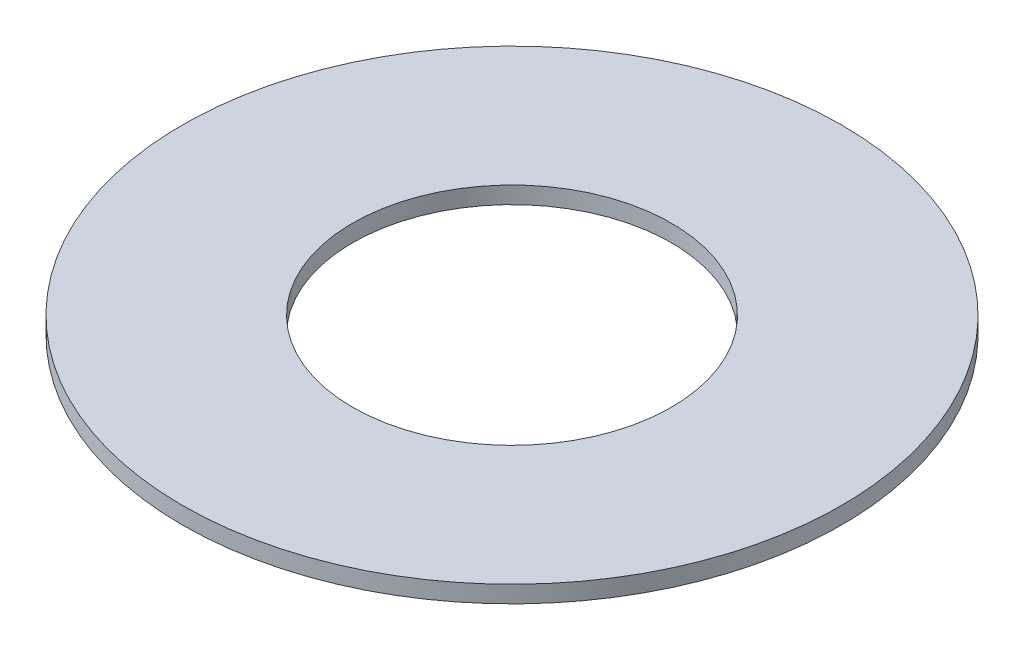
ISO-10303-21;
HEADER;
FILE_DESCRIPTION(('STEP AP214'),'2;1');
FILE_NAME('part.step','',(''),(''),'','','');
FILE_SCHEMA(('AUTOMOTIVE_DESIGN { 1 0 10303 214 1 1 1 1 }'));
ENDSEC;
DATA;
#1=APPLICATION_CONTEXT('core data for automotive mechanical design processes');
#2=APPLICATION_PROTOCOL_DEFINITION('international standard','automotive_design',2000,#1);
#3=PRODUCT_CONTEXT('',#1,'mechanical');
#4=PRODUCT('Part','Part','',(#3));
#5=PRODUCT_RELATED_PRODUCT_CATEGORY('part','',(#4));
#6=PRODUCT_DEFINITION_FORMATION('','',#4);
#7=PRODUCT_DEFINITION_CONTEXT('part definition',#1,'design');
#8=PRODUCT_DEFINITION('design','',#6,#7);
#9=PRODUCT_DEFINITION_SHAPE('','',#8);
#10=(LENGTH_UNIT() NAMED_UNIT(*) SI_UNIT(.MILLI.,.METRE.));
#11=(NAMED_UNIT(*) PLANE_ANGLE_UNIT() SI_UNIT($,.RADIAN.));
#12=(NAMED_UNIT(*) SI_UNIT($,.STERADIAN.) SOLID_ANGLE_UNIT());
#13=UNCERTAINTY_MEASURE_WITH_UNIT(LENGTH_MEASURE(1.E-05),#10,'distance_accuracy_value','');
#14=(GEOMETRIC_REPRESENTATION_CONTEXT(3) GLOBAL_UNCERTAINTY_ASSIGNED_CONTEXT((#13)) GLOBAL_UNIT_ASSIGNED_CONTEXT((#10,
#11,#12)) REPRESENTATION_CONTEXT('',''));
#15=CARTESIAN_POINT('',(0.,0.,0.));
#16=DIRECTION('',(0.,0.,1.));
#17=DIRECTION('',(1.,0.,0.));
#18=AXIS2_PLACEMENT_3D('',#15,#16,#17);
#19=CARTESIAN_POINT('',(0.,4.,0.));
#20=DIRECTION('',(0.,-1.,0.));
#21=DIRECTION('',(0.,0.,-1.));
#22=AXIS2_PLACEMENT_3D('',#19,#20,#21);
#23=CYLINDRICAL_SURFACE('',#22,77.5);
#24=CARTESIAN_POINT('',(0.,4.,0.));
#25=DIRECTION('',(0.,1.,0.));
#26=DIRECTION('',(0.,0.,1.));
#27=AXIS2_PLACEMENT_3D('',#24,#25,#26);
#28=CIRCLE('',#27,77.5);
#29=CARTESIAN_POINT('',(0.,4.,77.5));
#30=VERTEX_POINT('',#29);
#31=EDGE_CURVE('E10',#30,#30,#28,.T.);
#32=ORIENTED_EDGE('',*,*,#31,.F.);
#33=EDGE_LOOP('',(#32));
#34=FACE_BOUND('',#33,.T.);
#35=CARTESIAN_POINT('',(0.,0.,0.));
#36=DIRECTION('',(0.,1.,0.));
#37=DIRECTION('',(0.,0.,1.));
#38=AXIS2_PLACEMENT_3D('',#35,#36,#37);
#39=CIRCLE('',#38,77.5);
#40=CARTESIAN_POINT('',(0.,0.,77.5));
#41=VERTEX_POINT('',#40);
#42=EDGE_CURVE('E37',#41,#41,#39,.T.);
#43=ORIENTED_EDGE('',*,*,#42,.T.);
#44=EDGE_LOOP('',(#43));
#45=FACE_BOUND('',#44,.T.);
#46=ADVANCED_FACE('F40',(#34,#45),#23,.T.);
#47=CARTESIAN_POINT('',(0.,4.,0.));
#48=DIRECTION('',(0.,1.,0.));
#49=DIRECTION('',(0.,0.,1.));
#50=AXIS2_PLACEMENT_3D('',#47,#48,#49);
#51=PLANE('',#50);
#52=CARTESIAN_POINT('',(0.,4.,0.));
#53=DIRECTION('',(0.,1.,0.));
#54=DIRECTION('',(0.,0.,1.));
#55=AXIS2_PLACEMENT_3D('',#52,#53,#54);
#56=CIRCLE('',#55,37.5);
#57=CARTESIAN_POINT('',(0.,4.,37.5));
#58=VERTEX_POINT('',#57);
#59=EDGE_CURVE('E50',#58,#58,#56,.T.);
#60=ORIENTED_EDGE('',*,*,#59,.F.);
#61=EDGE_LOOP('',(#60));
#62=FACE_BOUND('',#61,.T.);
#63=ORIENTED_EDGE('',*,*,#31,.T.);
#64=EDGE_LOOP('',(#63));
#65=FACE_BOUND('',#64,.T.);
#66=ADVANCED_FACE('F59',(#62,#65),#51,.T.);
#67=CARTESIAN_POINT('',(0.,0.,0.));
#68=DIRECTION('',(0.,1.,0.));
#69=DIRECTION('',(0.,0.,1.));
#70=AXIS2_PLACEMENT_3D('',#67,#68,#69);
#71=PLANE('',#70);
#72=CARTESIAN_POINT('',(0.,0.,0.));
#73=DIRECTION('',(0.,1.,0.));
#74=DIRECTION('',(0.,0.,1.));
#75=AXIS2_PLACEMENT_3D('',#72,#73,#74);
#76=CIRCLE('',#75,37.5);
#77=CARTESIAN_POINT('',(0.,0.,37.5));
#78=VERTEX_POINT('',#77);
#79=EDGE_CURVE('E47',#78,#78,#76,.T.);
#80=ORIENTED_EDGE('',*,*,#79,.T.);
#81=EDGE_LOOP('',(#80));
#82=FACE_BOUND('',#81,.T.);
#83=ORIENTED_EDGE('',*,*,#42,.F.);
#84=EDGE_LOOP('',(#83));
#85=FACE_BOUND('',#84,.T.);
#86=ADVANCED_FACE('F58',(#82,#85),#71,.F.);
#87=CARTESIAN_POINT('',(0.,4.,0.));
#88=DIRECTION('',(0.,-1.,0.));
#89=DIRECTION('',(0.,0.,-1.));
#90=AXIS2_PLACEMENT_3D('',#87,#88,#89);
#91=CYLINDRICAL_SURFACE('',#90,37.5);
#92=ORIENTED_EDGE('',*,*,#59,.T.);
#93=EDGE_LOOP('',(#92));
#94=FACE_BOUND('',#93,.T.);
#95=ORIENTED_EDGE('',*,*,#79,.F.);
#96=EDGE_LOOP('',(#95));
#97=FACE_BOUND('',#96,.T.);
#98=ADVANCED_FACE('F54',(#94,#97),#91,.F.);
#99=CLOSED_SHELL('',(#46,#66,#86,#98));
#100=MANIFOLD_SOLID_BREP('B2',#99);
#101=ADVANCED_BREP_SHAPE_REPRESENTATION('',(#18,#100),#14);
#102=SHAPE_DEFINITION_REPRESENTATION(#9,#101);
ENDSEC;
END-ISO-10303-21;
